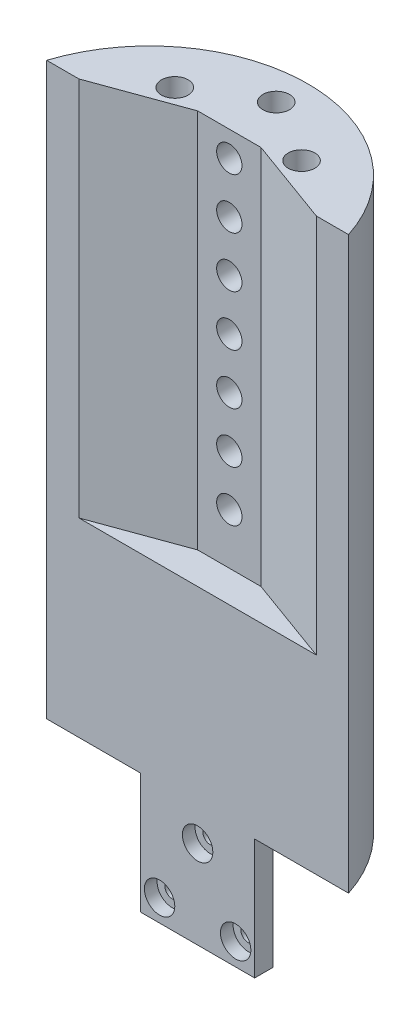
ISO-10303-21;
HEADER;
FILE_DESCRIPTION(('STEP AP214'),'2;1');
FILE_NAME('part.step','',(''),(''),'','','');
FILE_SCHEMA(('AUTOMOTIVE_DESIGN { 1 0 10303 214 1 1 1 1 }'));
ENDSEC;
DATA;
#1=APPLICATION_CONTEXT('core data for automotive mechanical design processes');
#2=APPLICATION_PROTOCOL_DEFINITION('international standard','automotive_design',2000,#1);
#3=PRODUCT_CONTEXT('',#1,'mechanical');
#4=PRODUCT('Part','Part','',(#3));
#5=PRODUCT_RELATED_PRODUCT_CATEGORY('part','',(#4));
#6=PRODUCT_DEFINITION_FORMATION('','',#4);
#7=PRODUCT_DEFINITION_CONTEXT('part definition',#1,'design');
#8=PRODUCT_DEFINITION('design','',#6,#7);
#9=PRODUCT_DEFINITION_SHAPE('','',#8);
#10=(LENGTH_UNIT() NAMED_UNIT(*) SI_UNIT(.MILLI.,.METRE.));
#11=(NAMED_UNIT(*) PLANE_ANGLE_UNIT() SI_UNIT($,.RADIAN.));
#12=(NAMED_UNIT(*) SI_UNIT($,.STERADIAN.) SOLID_ANGLE_UNIT());
#13=UNCERTAINTY_MEASURE_WITH_UNIT(LENGTH_MEASURE(1.E-05),#10,'distance_accuracy_value','');
#14=(GEOMETRIC_REPRESENTATION_CONTEXT(3) GLOBAL_UNCERTAINTY_ASSIGNED_CONTEXT((#13)) GLOBAL_UNIT_ASSIGNED_CONTEXT((#10,
#11,#12)) REPRESENTATION_CONTEXT('',''));
#15=CARTESIAN_POINT('',(0.,0.,0.));
#16=DIRECTION('',(0.,0.,1.));
#17=DIRECTION('',(1.,0.,0.));
#18=AXIS2_PLACEMENT_3D('',#15,#16,#17);
#19=CARTESIAN_POINT('',(0.,57.15,-9.652));
#20=DIRECTION('',(0.,0.,-1.));
#21=DIRECTION('',(-1.,0.,0.));
#22=AXIS2_PLACEMENT_3D('',#19,#20,#21);
#23=PLANE('',#22);
#24=CARTESIAN_POINT('',(0.,-63.6412473778275,-9.652));
#25=DIRECTION('',(0.,0.,1.));
#26=DIRECTION('',(1.,0.,0.));
#27=AXIS2_PLACEMENT_3D('',#24,#25,#26);
#28=CIRCLE('',#27,3.048);
#29=CARTESIAN_POINT('',(3.04799999999999,-63.6412473778275,-9.652));
#30=VERTEX_POINT('',#29);
#31=EDGE_CURVE('E270',#30,#30,#28,.T.);
#32=ORIENTED_EDGE('',*,*,#31,.F.);
#33=EDGE_LOOP('',(#32));
#34=FACE_BOUND('',#33,.T.);
#35=CARTESIAN_POINT('',(-7.62000000000001,-76.8394745315023,-9.652));
#36=DIRECTION('',(0.,0.,1.));
#37=DIRECTION('',(1.,0.,0.));
#38=AXIS2_PLACEMENT_3D('',#35,#36,#37);
#39=CIRCLE('',#38,3.048);
#40=CARTESIAN_POINT('',(-4.57200000000001,-76.8394745315023,-9.652));
#41=VERTEX_POINT('',#40);
#42=EDGE_CURVE('E274',#41,#41,#39,.T.);
#43=ORIENTED_EDGE('',*,*,#42,.F.);
#44=EDGE_LOOP('',(#43));
#45=FACE_BOUND('',#44,.T.);
#46=CARTESIAN_POINT('',(7.61999999999999,-76.8394745315023,-9.652));
#47=DIRECTION('',(0.,0.,1.));
#48=DIRECTION('',(1.,0.,0.));
#49=AXIS2_PLACEMENT_3D('',#46,#47,#48);
#50=CIRCLE('',#49,3.048);
#51=CARTESIAN_POINT('',(10.668,-76.8394745315023,-9.652));
#52=VERTEX_POINT('',#51);
#53=EDGE_CURVE('E282',#52,#52,#50,.T.);
#54=ORIENTED_EDGE('',*,*,#53,.F.);
#55=EDGE_LOOP('',(#54));
#56=FACE_BOUND('',#55,.T.);
#57=DIRECTION('',(0.,1.,0.));
#58=VECTOR('',#57,1.);
#59=CARTESIAN_POINT('',(23.796481613537,-37.6161579410358,-9.652));
#60=LINE('',#59,#58);
#61=CARTESIAN_POINT('',(23.796481613537,-19.05,-9.652));
#62=VERTEX_POINT('',#61);
#63=CARTESIAN_POINT('',(23.796481613537,57.15,-9.652));
#64=VERTEX_POINT('',#63);
#65=EDGE_CURVE('E140',#62,#64,#60,.T.);
#66=ORIENTED_EDGE('',*,*,#65,.F.);
#67=DIRECTION('',(1.,0.,0.));
#68=VECTOR('',#67,1.);
#69=CARTESIAN_POINT('',(6.35,-19.05,-9.652));
#70=LINE('',#69,#68);
#71=CARTESIAN_POINT('',(-23.796481613537,-19.05,-9.652));
#72=VERTEX_POINT('',#71);
#73=EDGE_CURVE('E124',#72,#62,#70,.T.);
#74=ORIENTED_EDGE('',*,*,#73,.F.);
#75=DIRECTION('',(0.,1.,0.));
#76=VECTOR('',#75,1.);
#77=CARTESIAN_POINT('',(-23.796481613537,-37.6161579410358,-9.652));
#78=LINE('',#77,#76);
#79=CARTESIAN_POINT('',(-23.796481613537,57.15,-9.652));
#80=VERTEX_POINT('',#79);
#81=EDGE_CURVE('E153',#72,#80,#78,.T.);
#82=ORIENTED_EDGE('',*,*,#81,.T.);
#83=DIRECTION('',(1.,0.,0.));
#84=VECTOR('',#83,1.);
#85=CARTESIAN_POINT('',(0.,57.15,-9.652));
#86=LINE('',#85,#84);
#87=CARTESIAN_POINT('',(-30.2473370067515,57.15,-9.652));
#88=VERTEX_POINT('',#87);
#89=EDGE_CURVE('E328',#88,#80,#86,.T.);
#90=ORIENTED_EDGE('',*,*,#89,.F.);
#91=DIRECTION('',(0.,-1.,0.));
#92=VECTOR('',#91,1.);
#93=CARTESIAN_POINT('',(-30.2473370067515,57.15,-9.652));
#94=LINE('',#93,#92);
#95=CARTESIAN_POINT('',(-30.2473370067515,-57.15,-9.652));
#96=VERTEX_POINT('',#95);
#97=EDGE_CURVE('E54',#88,#96,#94,.T.);
#98=ORIENTED_EDGE('',*,*,#97,.T.);
#99=DIRECTION('',(1.,0.,0.));
#100=VECTOR('',#99,1.);
#101=CARTESIAN_POINT('',(0.,-57.15,-9.652));
#102=LINE('',#101,#100);
#103=CARTESIAN_POINT('',(-11.43,-57.15,-9.652));
#104=VERTEX_POINT('',#103);
#105=EDGE_CURVE('E335',#96,#104,#102,.T.);
#106=ORIENTED_EDGE('',*,*,#105,.T.);
#107=DIRECTION('',(0.,1.,0.));
#108=VECTOR('',#107,1.);
#109=CARTESIAN_POINT('',(-11.43,-81.28,-9.652));
#110=LINE('',#109,#108);
#111=CARTESIAN_POINT('',(-11.43,-81.28,-9.652));
#112=VERTEX_POINT('',#111);
#113=EDGE_CURVE('E319',#112,#104,#110,.T.);
#114=ORIENTED_EDGE('',*,*,#113,.F.);
#115=DIRECTION('',(-1.,0.,0.));
#116=VECTOR('',#115,1.);
#117=CARTESIAN_POINT('',(0.,-81.28,-9.652));
#118=LINE('',#117,#116);
#119=CARTESIAN_POINT('',(11.43,-81.28,-9.652));
#120=VERTEX_POINT('',#119);
#121=EDGE_CURVE('E293',#120,#112,#118,.T.);
#122=ORIENTED_EDGE('',*,*,#121,.F.);
#123=DIRECTION('',(0.,1.,0.));
#124=VECTOR('',#123,1.);
#125=CARTESIAN_POINT('',(11.43,-81.28,-9.652));
#126=LINE('',#125,#124);
#127=CARTESIAN_POINT('',(11.43,-57.15,-9.652));
#128=VERTEX_POINT('',#127);
#129=EDGE_CURVE('E323',#120,#128,#126,.T.);
#130=ORIENTED_EDGE('',*,*,#129,.T.);
#131=CARTESIAN_POINT('',(30.2473370067515,-57.15,-9.652));
#132=VERTEX_POINT('',#131);
#133=EDGE_CURVE('E327',#128,#132,#102,.T.);
#134=ORIENTED_EDGE('',*,*,#133,.T.);
#135=DIRECTION('',(0.,-1.,0.));
#136=VECTOR('',#135,1.);
#137=CARTESIAN_POINT('',(30.2473370067515,57.15,-9.652));
#138=LINE('',#137,#136);
#139=CARTESIAN_POINT('',(30.2473370067515,57.15,-9.652));
#140=VERTEX_POINT('',#139);
#141=EDGE_CURVE('E11',#140,#132,#138,.T.);
#142=ORIENTED_EDGE('',*,*,#141,.F.);
#143=EDGE_CURVE('E146',#64,#140,#86,.T.);
#144=ORIENTED_EDGE('',*,*,#143,.F.);
#145=EDGE_LOOP('',(#66,#74,#82,#90,#98,#106,#114,#122,#130,#134,#142,#144));
#146=FACE_BOUND('',#145,.T.);
#147=ADVANCED_FACE('F45',(#34,#45,#56,#146),#23,.F.);
#148=CARTESIAN_POINT('',(0.,57.15,0.));
#149=DIRECTION('',(0.,-1.,0.));
#150=DIRECTION('',(0.,0.,-1.));
#151=AXIS2_PLACEMENT_3D('',#148,#149,#150);
#152=CYLINDRICAL_SURFACE('',#151,31.75);
#153=CARTESIAN_POINT('',(0.,-57.15,0.));
#154=DIRECTION('',(0.,1.,0.));
#155=DIRECTION('',(0.,0.,1.));
#156=AXIS2_PLACEMENT_3D('',#153,#154,#155);
#157=CIRCLE('',#156,31.75);
#158=EDGE_CURVE('E339',#132,#96,#157,.T.);
#159=ORIENTED_EDGE('',*,*,#158,.T.);
#160=ORIENTED_EDGE('',*,*,#97,.F.);
#161=CARTESIAN_POINT('',(0.,57.15,0.));
#162=DIRECTION('',(0.,1.,0.));
#163=DIRECTION('',(0.,0.,1.));
#164=AXIS2_PLACEMENT_3D('',#161,#162,#163);
#165=CIRCLE('',#164,31.75);
#166=EDGE_CURVE('E332',#140,#88,#165,.T.);
#167=ORIENTED_EDGE('',*,*,#166,.F.);
#168=ORIENTED_EDGE('',*,*,#141,.T.);
#169=EDGE_LOOP('',(#159,#160,#167,#168));
#170=FACE_BOUND('',#169,.T.);
#171=ADVANCED_FACE('F370',(#170),#152,.T.);
#172=CARTESIAN_POINT('',(0.,57.15,0.));
#173=DIRECTION('',(0.,1.,0.));
#174=DIRECTION('',(0.,0.,1.));
#175=AXIS2_PLACEMENT_3D('',#172,#173,#174);
#176=PLANE('',#175);
#177=DIRECTION('',(-0.939692620785909,0.,-0.342020143325666));
#178=VECTOR('',#177,1.);
#179=CARTESIAN_POINT('',(6.35,57.15,-16.002));
#180=LINE('',#179,#178);
#181=CARTESIAN_POINT('',(6.35,57.15,-16.002));
#182=VERTEX_POINT('',#181);
#183=EDGE_CURVE('E62',#64,#182,#180,.T.);
#184=ORIENTED_EDGE('',*,*,#183,.F.);
#185=ORIENTED_EDGE('',*,*,#143,.T.);
#186=ORIENTED_EDGE('',*,*,#166,.T.);
#187=ORIENTED_EDGE('',*,*,#89,.T.);
#188=DIRECTION('',(-0.939692620785909,0.,0.342020143325666));
#189=VECTOR('',#188,1.);
#190=CARTESIAN_POINT('',(-6.35000000000001,57.15,-16.002));
#191=LINE('',#190,#189);
#192=CARTESIAN_POINT('',(-6.35000000000001,57.15,-16.002));
#193=VERTEX_POINT('',#192);
#194=EDGE_CURVE('E150',#193,#80,#191,.T.);
#195=ORIENTED_EDGE('',*,*,#194,.F.);
#196=DIRECTION('',(-1.,0.,0.));
#197=VECTOR('',#196,1.);
#198=CARTESIAN_POINT('',(6.34999999999999,57.15,-16.002));
#199=LINE('',#198,#197);
#200=EDGE_CURVE('E240',#182,#193,#199,.T.);
#201=ORIENTED_EDGE('',*,*,#200,.F.);
#202=EDGE_LOOP('',(#184,#185,#186,#187,#195,#201));
#203=FACE_BOUND('',#202,.T.);
#204=CARTESIAN_POINT('',(0.,57.15,-25.4));
#205=DIRECTION('',(0.,1.,0.));
#206=DIRECTION('',(0.,0.,1.));
#207=AXIS2_PLACEMENT_3D('',#204,#205,#206);
#208=CIRCLE('',#207,2.667);
#209=CARTESIAN_POINT('',(0.,57.15,-22.733));
#210=VERTEX_POINT('',#209);
#211=EDGE_CURVE('E219',#210,#210,#208,.T.);
#212=ORIENTED_EDGE('',*,*,#211,.F.);
#213=EDGE_LOOP('',(#212));
#214=FACE_BOUND('',#213,.T.);
#215=CARTESIAN_POINT('',(-12.7,57.15,-17.78));
#216=DIRECTION('',(0.,1.,0.));
#217=DIRECTION('',(0.,0.,1.));
#218=AXIS2_PLACEMENT_3D('',#215,#216,#217);
#219=CIRCLE('',#218,2.667);
#220=CARTESIAN_POINT('',(-12.7,57.15,-15.113));
#221=VERTEX_POINT('',#220);
#222=EDGE_CURVE('E227',#221,#221,#219,.T.);
#223=ORIENTED_EDGE('',*,*,#222,.F.);
#224=EDGE_LOOP('',(#223));
#225=FACE_BOUND('',#224,.T.);
#226=CARTESIAN_POINT('',(12.7,57.15,-17.78));
#227=DIRECTION('',(0.,1.,0.));
#228=DIRECTION('',(0.,0.,1.));
#229=AXIS2_PLACEMENT_3D('',#226,#227,#228);
#230=CIRCLE('',#229,2.667);
#231=CARTESIAN_POINT('',(12.7,57.15,-15.113));
#232=VERTEX_POINT('',#231);
#233=EDGE_CURVE('E164',#232,#232,#230,.T.);
#234=ORIENTED_EDGE('',*,*,#233,.F.);
#235=EDGE_LOOP('',(#234));
#236=FACE_BOUND('',#235,.T.);
#237=ADVANCED_FACE('F375',(#203,#214,#225,#236),#176,.T.);
#238=CARTESIAN_POINT('',(0.,-57.15,0.));
#239=DIRECTION('',(0.,1.,0.));
#240=DIRECTION('',(0.,0.,1.));
#241=AXIS2_PLACEMENT_3D('',#238,#239,#240);
#242=PLANE('',#241);
#243=ORIENTED_EDGE('',*,*,#133,.F.);
#244=DIRECTION('',(0.,0.,-1.));
#245=VECTOR('',#244,1.);
#246=CARTESIAN_POINT('',(11.43,-57.15,0.));
#247=LINE('',#246,#245);
#248=CARTESIAN_POINT('',(11.43,-57.15,-13.335));
#249=VERTEX_POINT('',#248);
#250=EDGE_CURVE('E70',#128,#249,#247,.T.);
#251=ORIENTED_EDGE('',*,*,#250,.T.);
#252=DIRECTION('',(1.,0.,0.));
#253=VECTOR('',#252,1.);
#254=CARTESIAN_POINT('',(0.,-57.15,-13.335));
#255=LINE('',#254,#253);
#256=CARTESIAN_POINT('',(-11.43,-57.15,-13.335));
#257=VERTEX_POINT('',#256);
#258=EDGE_CURVE('E294',#257,#249,#255,.T.);
#259=ORIENTED_EDGE('',*,*,#258,.F.);
#260=DIRECTION('',(0.,0.,-1.));
#261=VECTOR('',#260,1.);
#262=CARTESIAN_POINT('',(-11.43,-57.15,0.));
#263=LINE('',#262,#261);
#264=EDGE_CURVE('E306',#104,#257,#263,.T.);
#265=ORIENTED_EDGE('',*,*,#264,.F.);
#266=ORIENTED_EDGE('',*,*,#105,.F.);
#267=ORIENTED_EDGE('',*,*,#158,.F.);
#268=EDGE_LOOP('',(#243,#251,#259,#265,#266,#267));
#269=FACE_BOUND('',#268,.T.);
#270=ADVANCED_FACE('F413',(#269),#242,.F.);
#271=CARTESIAN_POINT('',(11.43,-81.28,0.));
#272=DIRECTION('',(1.,0.,0.));
#273=DIRECTION('',(0.,0.,-1.));
#274=AXIS2_PLACEMENT_3D('',#271,#272,#273);
#275=PLANE('',#274);
#276=ORIENTED_EDGE('',*,*,#250,.F.);
#277=ORIENTED_EDGE('',*,*,#129,.F.);
#278=DIRECTION('',(0.,0.,-1.));
#279=VECTOR('',#278,1.);
#280=CARTESIAN_POINT('',(11.43,-81.28,0.));
#281=LINE('',#280,#279);
#282=CARTESIAN_POINT('',(11.43,-81.28,-13.335));
#283=VERTEX_POINT('',#282);
#284=EDGE_CURVE('E289',#120,#283,#281,.T.);
#285=ORIENTED_EDGE('',*,*,#284,.T.);
#286=DIRECTION('',(0.,1.,0.));
#287=VECTOR('',#286,1.);
#288=CARTESIAN_POINT('',(11.43,-81.28,-13.335));
#289=LINE('',#288,#287);
#290=EDGE_CURVE('E303',#283,#249,#289,.T.);
#291=ORIENTED_EDGE('',*,*,#290,.T.);
#292=EDGE_LOOP('',(#276,#277,#285,#291));
#293=FACE_BOUND('',#292,.T.);
#294=ADVANCED_FACE('F409',(#293),#275,.T.);
#295=CARTESIAN_POINT('',(-11.43,-81.28,0.));
#296=DIRECTION('',(1.,0.,0.));
#297=DIRECTION('',(0.,0.,-1.));
#298=AXIS2_PLACEMENT_3D('',#295,#296,#297);
#299=PLANE('',#298);
#300=ORIENTED_EDGE('',*,*,#264,.T.);
#301=DIRECTION('',(0.,1.,0.));
#302=VECTOR('',#301,1.);
#303=CARTESIAN_POINT('',(-11.43,-81.28,-13.335));
#304=LINE('',#303,#302);
#305=CARTESIAN_POINT('',(-11.43,-81.28,-13.335));
#306=VERTEX_POINT('',#305);
#307=EDGE_CURVE('E315',#306,#257,#304,.T.);
#308=ORIENTED_EDGE('',*,*,#307,.F.);
#309=DIRECTION('',(0.,0.,-1.));
#310=VECTOR('',#309,1.);
#311=CARTESIAN_POINT('',(-11.43,-81.28,0.));
#312=LINE('',#311,#310);
#313=EDGE_CURVE('E297',#112,#306,#312,.T.);
#314=ORIENTED_EDGE('',*,*,#313,.F.);
#315=ORIENTED_EDGE('',*,*,#113,.T.);
#316=EDGE_LOOP('',(#300,#308,#314,#315));
#317=FACE_BOUND('',#316,.T.);
#318=ADVANCED_FACE('F405',(#317),#299,.F.);
#319=CARTESIAN_POINT('',(0.,-81.28,-13.335));
#320=DIRECTION('',(0.,0.,1.));
#321=DIRECTION('',(1.,0.,0.));
#322=AXIS2_PLACEMENT_3D('',#319,#320,#321);
#323=PLANE('',#322);
#324=CARTESIAN_POINT('',(0.,-63.6412473778275,-13.335));
#325=DIRECTION('',(0.,0.,1.));
#326=DIRECTION('',(1.,0.,0.));
#327=AXIS2_PLACEMENT_3D('',#324,#325,#326);
#328=CIRCLE('',#327,1.49999999999999);
#329=CARTESIAN_POINT('',(1.49999999999998,-63.6412473778275,-13.335));
#330=VERTEX_POINT('',#329);
#331=EDGE_CURVE('E48',#330,#330,#328,.T.);
#332=ORIENTED_EDGE('',*,*,#331,.T.);
#333=EDGE_LOOP('',(#332));
#334=FACE_BOUND('',#333,.T.);
#335=CARTESIAN_POINT('',(7.61999999999999,-76.8394745315023,-13.335));
#336=DIRECTION('',(0.,0.,1.));
#337=DIRECTION('',(1.,0.,0.));
#338=AXIS2_PLACEMENT_3D('',#335,#336,#337);
#339=CIRCLE('',#338,1.49999999999999);
#340=CARTESIAN_POINT('',(9.11999999999998,-76.8394745315023,-13.335));
#341=VERTEX_POINT('',#340);
#342=EDGE_CURVE('E255',#341,#341,#339,.T.);
#343=ORIENTED_EDGE('',*,*,#342,.T.);
#344=EDGE_LOOP('',(#343));
#345=FACE_BOUND('',#344,.T.);
#346=CARTESIAN_POINT('',(-7.62000000000001,-76.8394745315023,-13.335));
#347=DIRECTION('',(0.,0.,1.));
#348=DIRECTION('',(1.,0.,0.));
#349=AXIS2_PLACEMENT_3D('',#346,#347,#348);
#350=CIRCLE('',#349,1.49999999999999);
#351=CARTESIAN_POINT('',(-6.12000000000002,-76.8394745315023,-13.335));
#352=VERTEX_POINT('',#351);
#353=EDGE_CURVE('E261',#352,#352,#350,.T.);
#354=ORIENTED_EDGE('',*,*,#353,.T.);
#355=EDGE_LOOP('',(#354));
#356=FACE_BOUND('',#355,.T.);
#357=ORIENTED_EDGE('',*,*,#258,.T.);
#358=ORIENTED_EDGE('',*,*,#290,.F.);
#359=DIRECTION('',(1.,0.,0.));
#360=VECTOR('',#359,1.);
#361=CARTESIAN_POINT('',(0.,-81.28,-13.335));
#362=LINE('',#361,#360);
#363=EDGE_CURVE('E300',#306,#283,#362,.T.);
#364=ORIENTED_EDGE('',*,*,#363,.F.);
#365=ORIENTED_EDGE('',*,*,#307,.T.);
#366=EDGE_LOOP('',(#357,#358,#364,#365));
#367=FACE_BOUND('',#366,.T.);
#368=ADVANCED_FACE('F351',(#334,#345,#356,#367),#323,.F.);
#369=CARTESIAN_POINT('',(0.,-81.28,0.));
#370=DIRECTION('',(0.,-1.,0.));
#371=DIRECTION('',(0.,0.,-1.));
#372=AXIS2_PLACEMENT_3D('',#369,#370,#371);
#373=PLANE('',#372);
#374=ORIENTED_EDGE('',*,*,#284,.F.);
#375=ORIENTED_EDGE('',*,*,#121,.T.);
#376=ORIENTED_EDGE('',*,*,#313,.T.);
#377=ORIENTED_EDGE('',*,*,#363,.T.);
#378=EDGE_LOOP('',(#374,#375,#376,#377));
#379=FACE_BOUND('',#378,.T.);
#380=ADVANCED_FACE('F386',(#379),#373,.T.);
#381=CARTESIAN_POINT('',(7.61999999999999,-76.8394745315023,-12.192));
#382=DIRECTION('',(0.,0.,1.));
#383=DIRECTION('',(1.,0.,0.));
#384=AXIS2_PLACEMENT_3D('',#381,#382,#383);
#385=CYLINDRICAL_SURFACE('',#384,3.048);
#386=CARTESIAN_POINT('',(7.61999999999999,-76.8394745315023,-12.192));
#387=DIRECTION('',(0.,0.,1.));
#388=DIRECTION('',(1.,0.,0.));
#389=AXIS2_PLACEMENT_3D('',#386,#387,#388);
#390=CIRCLE('',#389,3.048);
#391=CARTESIAN_POINT('',(10.668,-76.8394745315023,-12.192));
#392=VERTEX_POINT('',#391);
#393=EDGE_CURVE('E265',#392,#392,#390,.T.);
#394=ORIENTED_EDGE('',*,*,#393,.F.);
#395=EDGE_LOOP('',(#394));
#396=FACE_BOUND('',#395,.T.);
#397=ORIENTED_EDGE('',*,*,#53,.T.);
#398=EDGE_LOOP('',(#397));
#399=FACE_BOUND('',#398,.T.);
#400=ADVANCED_FACE('F383',(#396,#399),#385,.F.);
#401=CARTESIAN_POINT('',(7.61999999999999,-76.8394745315023,-12.192));
#402=DIRECTION('',(0.,0.,1.));
#403=DIRECTION('',(1.,0.,0.));
#404=AXIS2_PLACEMENT_3D('',#401,#402,#403);
#405=PLANE('',#404);
#406=CARTESIAN_POINT('',(7.61999999999999,-76.8394745315023,-12.192));
#407=DIRECTION('',(0.,0.,1.));
#408=DIRECTION('',(1.,0.,0.));
#409=AXIS2_PLACEMENT_3D('',#406,#407,#408);
#410=CIRCLE('',#409,1.49999999999999);
#411=CARTESIAN_POINT('',(9.11999999999998,-76.8394745315023,-12.192));
#412=VERTEX_POINT('',#411);
#413=EDGE_CURVE('E256',#412,#412,#410,.T.);
#414=ORIENTED_EDGE('',*,*,#413,.F.);
#415=EDGE_LOOP('',(#414));
#416=FACE_BOUND('',#415,.T.);
#417=ORIENTED_EDGE('',*,*,#393,.T.);
#418=EDGE_LOOP('',(#417));
#419=FACE_BOUND('',#418,.T.);
#420=ADVANCED_FACE('F385',(#416,#419),#405,.T.);
#421=CARTESIAN_POINT('',(-7.62000000000001,-76.8394745315023,-12.192));
#422=DIRECTION('',(0.,0.,1.));
#423=DIRECTION('',(1.,0.,0.));
#424=AXIS2_PLACEMENT_3D('',#421,#422,#423);
#425=CYLINDRICAL_SURFACE('',#424,3.048);
#426=CARTESIAN_POINT('',(-7.62000000000001,-76.8394745315023,-12.192));
#427=DIRECTION('',(0.,0.,1.));
#428=DIRECTION('',(1.,0.,0.));
#429=AXIS2_PLACEMENT_3D('',#426,#427,#428);
#430=CIRCLE('',#429,3.048);
#431=CARTESIAN_POINT('',(-4.57200000000001,-76.8394745315023,-12.192));
#432=VERTEX_POINT('',#431);
#433=EDGE_CURVE('E278',#432,#432,#430,.T.);
#434=ORIENTED_EDGE('',*,*,#433,.F.);
#435=EDGE_LOOP('',(#434));
#436=FACE_BOUND('',#435,.T.);
#437=ORIENTED_EDGE('',*,*,#42,.T.);
#438=EDGE_LOOP('',(#437));
#439=FACE_BOUND('',#438,.T.);
#440=ADVANCED_FACE('F393',(#436,#439),#425,.F.);
#441=CARTESIAN_POINT('',(-7.62000000000001,-76.8394745315023,-12.192));
#442=DIRECTION('',(0.,0.,1.));
#443=DIRECTION('',(1.,0.,0.));
#444=AXIS2_PLACEMENT_3D('',#441,#442,#443);
#445=PLANE('',#444);
#446=CARTESIAN_POINT('',(-7.62000000000001,-76.8394745315023,-12.192));
#447=DIRECTION('',(0.,0.,1.));
#448=DIRECTION('',(1.,0.,0.));
#449=AXIS2_PLACEMENT_3D('',#446,#447,#448);
#450=CIRCLE('',#449,1.49999999999999);
#451=CARTESIAN_POINT('',(-6.12000000000002,-76.8394745315023,-12.192));
#452=VERTEX_POINT('',#451);
#453=EDGE_CURVE('E260',#452,#452,#450,.T.);
#454=ORIENTED_EDGE('',*,*,#453,.F.);
#455=EDGE_LOOP('',(#454));
#456=FACE_BOUND('',#455,.T.);
#457=ORIENTED_EDGE('',*,*,#433,.T.);
#458=EDGE_LOOP('',(#457));
#459=FACE_BOUND('',#458,.T.);
#460=ADVANCED_FACE('F400',(#456,#459),#445,.T.);
#461=CARTESIAN_POINT('',(0.,-63.6412473778275,-12.192));
#462=DIRECTION('',(0.,0.,1.));
#463=DIRECTION('',(1.,0.,0.));
#464=AXIS2_PLACEMENT_3D('',#461,#462,#463);
#465=CYLINDRICAL_SURFACE('',#464,3.048);
#466=CARTESIAN_POINT('',(0.,-63.6412473778275,-12.192));
#467=DIRECTION('',(0.,0.,1.));
#468=DIRECTION('',(1.,0.,0.));
#469=AXIS2_PLACEMENT_3D('',#466,#467,#468);
#470=CIRCLE('',#469,3.048);
#471=CARTESIAN_POINT('',(3.04799999999999,-63.6412473778275,-12.192));
#472=VERTEX_POINT('',#471);
#473=EDGE_CURVE('E266',#472,#472,#470,.T.);
#474=ORIENTED_EDGE('',*,*,#473,.F.);
#475=EDGE_LOOP('',(#474));
#476=FACE_BOUND('',#475,.T.);
#477=ORIENTED_EDGE('',*,*,#31,.T.);
#478=EDGE_LOOP('',(#477));
#479=FACE_BOUND('',#478,.T.);
#480=ADVANCED_FACE('F691',(#476,#479),#465,.F.);
#481=CARTESIAN_POINT('',(0.,-63.6412473778275,-12.192));
#482=DIRECTION('',(0.,0.,1.));
#483=DIRECTION('',(1.,0.,0.));
#484=AXIS2_PLACEMENT_3D('',#481,#482,#483);
#485=PLANE('',#484);
#486=CARTESIAN_POINT('',(0.,-63.6412473778275,-12.192));
#487=DIRECTION('',(0.,0.,1.));
#488=DIRECTION('',(1.,0.,0.));
#489=AXIS2_PLACEMENT_3D('',#486,#487,#488);
#490=CIRCLE('',#489,1.49999999999999);
#491=CARTESIAN_POINT('',(1.49999999999998,-63.6412473778275,-12.192));
#492=VERTEX_POINT('',#491);
#493=EDGE_CURVE('E251',#492,#492,#490,.T.);
#494=ORIENTED_EDGE('',*,*,#493,.F.);
#495=EDGE_LOOP('',(#494));
#496=FACE_BOUND('',#495,.T.);
#497=ORIENTED_EDGE('',*,*,#473,.T.);
#498=EDGE_LOOP('',(#497));
#499=FACE_BOUND('',#498,.T.);
#500=ADVANCED_FACE('F366',(#496,#499),#485,.T.);
#501=CARTESIAN_POINT('',(-7.62000000000001,-76.8394745315023,-9.652));
#502=DIRECTION('',(0.,0.,1.));
#503=DIRECTION('',(1.,0.,0.));
#504=AXIS2_PLACEMENT_3D('',#501,#502,#503);
#505=CYLINDRICAL_SURFACE('',#504,1.49999999999999);
#506=ORIENTED_EDGE('',*,*,#453,.T.);
#507=EDGE_LOOP('',(#506));
#508=FACE_BOUND('',#507,.T.);
#509=ORIENTED_EDGE('',*,*,#353,.F.);
#510=EDGE_LOOP('',(#509));
#511=FACE_BOUND('',#510,.T.);
#512=ADVANCED_FACE('F357',(#508,#511),#505,.F.);
#513=CARTESIAN_POINT('',(7.61999999999999,-76.8394745315023,-9.652));
#514=DIRECTION('',(0.,0.,1.));
#515=DIRECTION('',(1.,0.,0.));
#516=AXIS2_PLACEMENT_3D('',#513,#514,#515);
#517=CYLINDRICAL_SURFACE('',#516,1.49999999999999);
#518=ORIENTED_EDGE('',*,*,#413,.T.);
#519=EDGE_LOOP('',(#518));
#520=FACE_BOUND('',#519,.T.);
#521=ORIENTED_EDGE('',*,*,#342,.F.);
#522=EDGE_LOOP('',(#521));
#523=FACE_BOUND('',#522,.T.);
#524=ADVANCED_FACE('F354',(#520,#523),#517,.F.);
#525=CARTESIAN_POINT('',(0.,-63.6412473778275,-9.652));
#526=DIRECTION('',(0.,0.,1.));
#527=DIRECTION('',(1.,0.,0.));
#528=AXIS2_PLACEMENT_3D('',#525,#526,#527);
#529=CYLINDRICAL_SURFACE('',#528,1.49999999999999);
#530=ORIENTED_EDGE('',*,*,#493,.T.);
#531=EDGE_LOOP('',(#530));
#532=FACE_BOUND('',#531,.T.);
#533=ORIENTED_EDGE('',*,*,#331,.F.);
#534=EDGE_LOOP('',(#533));
#535=FACE_BOUND('',#534,.T.);
#536=ADVANCED_FACE('F356',(#532,#535),#529,.F.);
#537=CARTESIAN_POINT('',(6.35,-19.05,-16.002));
#538=DIRECTION('',(0.,-1.,0.));
#539=DIRECTION('',(0.,0.,-1.));
#540=AXIS2_PLACEMENT_3D('',#537,#538,#539);
#541=PLANE('',#540);
#542=ORIENTED_EDGE('',*,*,#73,.T.);
#543=DIRECTION('',(-0.93969262078591,0.,-0.342020143325666));
#544=VECTOR('',#543,1.);
#545=CARTESIAN_POINT('',(6.35,-19.05,-16.002));
#546=LINE('',#545,#544);
#547=CARTESIAN_POINT('',(6.35,-19.05,-16.002));
#548=VERTEX_POINT('',#547);
#549=EDGE_CURVE('E128',#62,#548,#546,.T.);
#550=ORIENTED_EDGE('',*,*,#549,.T.);
#551=DIRECTION('',(1.,0.,0.));
#552=VECTOR('',#551,1.);
#553=CARTESIAN_POINT('',(6.35,-19.05,-16.002));
#554=LINE('',#553,#552);
#555=CARTESIAN_POINT('',(-6.35,-19.05,-16.002));
#556=VERTEX_POINT('',#555);
#557=EDGE_CURVE('E248',#556,#548,#554,.T.);
#558=ORIENTED_EDGE('',*,*,#557,.F.);
#559=DIRECTION('',(-0.93969262078591,0.,0.342020143325666));
#560=VECTOR('',#559,1.);
#561=CARTESIAN_POINT('',(-6.35000000000001,-19.05,-16.002));
#562=LINE('',#561,#560);
#563=EDGE_CURVE('E130',#556,#72,#562,.T.);
#564=ORIENTED_EDGE('',*,*,#563,.T.);
#565=EDGE_LOOP('',(#542,#550,#558,#564));
#566=FACE_BOUND('',#565,.T.);
#567=ADVANCED_FACE('F126',(#566),#541,.F.);
#568=CARTESIAN_POINT('',(0.,0.,-16.002));
#569=DIRECTION('',(0.,0.,-1.));
#570=DIRECTION('',(-1.,0.,0.));
#571=AXIS2_PLACEMENT_3D('',#568,#569,#570);
#572=PLANE('',#571);
#573=CARTESIAN_POINT('',(0.,52.07,-16.002));
#574=DIRECTION('',(0.,0.,1.));
#575=DIRECTION('',(1.,0.,0.));
#576=AXIS2_PLACEMENT_3D('',#573,#574,#575);
#577=CIRCLE('',#576,2.54);
#578=CARTESIAN_POINT('',(2.54,52.07,-16.002));
#579=VERTEX_POINT('',#578);
#580=EDGE_CURVE('E165',#579,#579,#577,.T.);
#581=ORIENTED_EDGE('',*,*,#580,.F.);
#582=EDGE_LOOP('',(#581));
#583=FACE_BOUND('',#582,.T.);
#584=CARTESIAN_POINT('',(0.,41.91,-16.002));
#585=DIRECTION('',(0.,0.,1.));
#586=DIRECTION('',(1.,0.,0.));
#587=AXIS2_PLACEMENT_3D('',#584,#585,#586);
#588=CIRCLE('',#587,2.54);
#589=CARTESIAN_POINT('',(2.54,41.91,-16.002));
#590=VERTEX_POINT('',#589);
#591=EDGE_CURVE('E169',#590,#590,#588,.T.);
#592=ORIENTED_EDGE('',*,*,#591,.F.);
#593=EDGE_LOOP('',(#592));
#594=FACE_BOUND('',#593,.T.);
#595=CARTESIAN_POINT('',(0.,31.75,-16.002));
#596=DIRECTION('',(0.,0.,1.));
#597=DIRECTION('',(1.,0.,0.));
#598=AXIS2_PLACEMENT_3D('',#595,#596,#597);
#599=CIRCLE('',#598,2.54);
#600=CARTESIAN_POINT('',(2.54,31.75,-16.002));
#601=VERTEX_POINT('',#600);
#602=EDGE_CURVE('E177',#601,#601,#599,.T.);
#603=ORIENTED_EDGE('',*,*,#602,.F.);
#604=EDGE_LOOP('',(#603));
#605=FACE_BOUND('',#604,.T.);
#606=CARTESIAN_POINT('',(0.,21.59,-16.002));
#607=DIRECTION('',(0.,0.,1.));
#608=DIRECTION('',(1.,0.,0.));
#609=AXIS2_PLACEMENT_3D('',#606,#607,#608);
#610=CIRCLE('',#609,2.54);
#611=CARTESIAN_POINT('',(2.54,21.59,-16.002));
#612=VERTEX_POINT('',#611);
#613=EDGE_CURVE('E185',#612,#612,#610,.T.);
#614=ORIENTED_EDGE('',*,*,#613,.F.);
#615=EDGE_LOOP('',(#614));
#616=FACE_BOUND('',#615,.T.);
#617=CARTESIAN_POINT('',(0.,11.43,-16.002));
#618=DIRECTION('',(0.,0.,1.));
#619=DIRECTION('',(1.,0.,0.));
#620=AXIS2_PLACEMENT_3D('',#617,#618,#619);
#621=CIRCLE('',#620,2.54);
#622=CARTESIAN_POINT('',(2.54,11.43,-16.002));
#623=VERTEX_POINT('',#622);
#624=EDGE_CURVE('E193',#623,#623,#621,.T.);
#625=ORIENTED_EDGE('',*,*,#624,.F.);
#626=EDGE_LOOP('',(#625));
#627=FACE_BOUND('',#626,.T.);
#628=CARTESIAN_POINT('',(0.,1.27,-16.002));
#629=DIRECTION('',(0.,0.,1.));
#630=DIRECTION('',(1.,0.,0.));
#631=AXIS2_PLACEMENT_3D('',#628,#629,#630);
#632=CIRCLE('',#631,2.54);
#633=CARTESIAN_POINT('',(2.54,1.27,-16.002));
#634=VERTEX_POINT('',#633);
#635=EDGE_CURVE('E201',#634,#634,#632,.T.);
#636=ORIENTED_EDGE('',*,*,#635,.F.);
#637=EDGE_LOOP('',(#636));
#638=FACE_BOUND('',#637,.T.);
#639=CARTESIAN_POINT('',(0.,-8.89,-16.002));
#640=DIRECTION('',(0.,0.,1.));
#641=DIRECTION('',(1.,0.,0.));
#642=AXIS2_PLACEMENT_3D('',#639,#640,#641);
#643=CIRCLE('',#642,2.54);
#644=CARTESIAN_POINT('',(2.54,-8.89,-16.002));
#645=VERTEX_POINT('',#644);
#646=EDGE_CURVE('E209',#645,#645,#643,.T.);
#647=ORIENTED_EDGE('',*,*,#646,.F.);
#648=EDGE_LOOP('',(#647));
#649=FACE_BOUND('',#648,.T.);
#650=DIRECTION('',(0.,1.,0.));
#651=VECTOR('',#650,1.);
#652=CARTESIAN_POINT('',(6.34999999999999,57.15,-16.002));
#653=LINE('',#652,#651);
#654=EDGE_CURVE('E136',#548,#182,#653,.T.);
#655=ORIENTED_EDGE('',*,*,#654,.T.);
#656=ORIENTED_EDGE('',*,*,#200,.T.);
#657=DIRECTION('',(0.,-1.,0.));
#658=VECTOR('',#657,1.);
#659=CARTESIAN_POINT('',(-6.35000000000001,57.15,-16.002));
#660=LINE('',#659,#658);
#661=EDGE_CURVE('E244',#193,#556,#660,.T.);
#662=ORIENTED_EDGE('',*,*,#661,.T.);
#663=ORIENTED_EDGE('',*,*,#557,.T.);
#664=EDGE_LOOP('',(#655,#656,#662,#663));
#665=FACE_BOUND('',#664,.T.);
#666=ADVANCED_FACE('F440',(#583,#594,#605,#616,#627,#638,#649,#665),#572,.F.);
#667=CARTESIAN_POINT('',(12.7,52.07,-17.78));
#668=DIRECTION('',(0.,1.,0.));
#669=DIRECTION('',(0.,0.,1.));
#670=AXIS2_PLACEMENT_3D('',#667,#668,#669);
#671=CYLINDRICAL_SURFACE('',#670,2.667);
#672=CARTESIAN_POINT('',(12.7,52.07,-17.78));
#673=DIRECTION('',(0.,1.,0.));
#674=DIRECTION('',(0.,0.,1.));
#675=AXIS2_PLACEMENT_3D('',#672,#673,#674);
#676=CIRCLE('',#675,2.667);
#677=CARTESIAN_POINT('',(12.7,52.07,-15.113));
#678=VERTEX_POINT('',#677);
#679=EDGE_CURVE('E231',#678,#678,#676,.T.);
#680=ORIENTED_EDGE('',*,*,#679,.F.);
#681=EDGE_LOOP('',(#680));
#682=FACE_BOUND('',#681,.T.);
#683=ORIENTED_EDGE('',*,*,#233,.T.);
#684=EDGE_LOOP('',(#683));
#685=FACE_BOUND('',#684,.T.);
#686=ADVANCED_FACE('F525',(#682,#685),#671,.F.);
#687=CARTESIAN_POINT('',(0.,52.07,0.));
#688=DIRECTION('',(0.,1.,0.));
#689=DIRECTION('',(0.,0.,1.));
#690=AXIS2_PLACEMENT_3D('',#687,#688,#689);
#691=PLANE('',#690);
#692=ORIENTED_EDGE('',*,*,#679,.T.);
#693=EDGE_LOOP('',(#692));
#694=FACE_BOUND('',#693,.T.);
#695=ADVANCED_FACE('F521',(#694),#691,.T.);
#696=CARTESIAN_POINT('',(-12.7,52.07,-17.78));
#697=DIRECTION('',(0.,1.,0.));
#698=DIRECTION('',(0.,0.,1.));
#699=AXIS2_PLACEMENT_3D('',#696,#697,#698);
#700=CYLINDRICAL_SURFACE('',#699,2.667);
#701=CARTESIAN_POINT('',(-12.7,52.07,-17.78));
#702=DIRECTION('',(0.,1.,0.));
#703=DIRECTION('',(0.,0.,1.));
#704=AXIS2_PLACEMENT_3D('',#701,#702,#703);
#705=CIRCLE('',#704,2.667);
#706=CARTESIAN_POINT('',(-12.7,52.07,-15.113));
#707=VERTEX_POINT('',#706);
#708=EDGE_CURVE('E223',#707,#707,#705,.T.);
#709=ORIENTED_EDGE('',*,*,#708,.F.);
#710=EDGE_LOOP('',(#709));
#711=FACE_BOUND('',#710,.T.);
#712=ORIENTED_EDGE('',*,*,#222,.T.);
#713=EDGE_LOOP('',(#712));
#714=FACE_BOUND('',#713,.T.);
#715=ADVANCED_FACE('F517',(#711,#714),#700,.F.);
#716=CARTESIAN_POINT('',(0.,52.07,0.));
#717=DIRECTION('',(0.,1.,0.));
#718=DIRECTION('',(0.,0.,1.));
#719=AXIS2_PLACEMENT_3D('',#716,#717,#718);
#720=PLANE('',#719);
#721=ORIENTED_EDGE('',*,*,#708,.T.);
#722=EDGE_LOOP('',(#721));
#723=FACE_BOUND('',#722,.T.);
#724=ADVANCED_FACE('F513',(#723),#720,.T.);
#725=CARTESIAN_POINT('',(0.,52.07,-25.4));
#726=DIRECTION('',(0.,1.,0.));
#727=DIRECTION('',(0.,0.,1.));
#728=AXIS2_PLACEMENT_3D('',#725,#726,#727);
#729=CYLINDRICAL_SURFACE('',#728,2.667);
#730=CARTESIAN_POINT('',(0.,52.07,-25.4));
#731=DIRECTION('',(0.,1.,0.));
#732=DIRECTION('',(0.,0.,1.));
#733=AXIS2_PLACEMENT_3D('',#730,#731,#732);
#734=CIRCLE('',#733,2.667);
#735=CARTESIAN_POINT('',(0.,52.07,-22.733));
#736=VERTEX_POINT('',#735);
#737=EDGE_CURVE('E137',#736,#736,#734,.T.);
#738=ORIENTED_EDGE('',*,*,#737,.F.);
#739=EDGE_LOOP('',(#738));
#740=FACE_BOUND('',#739,.T.);
#741=ORIENTED_EDGE('',*,*,#211,.T.);
#742=EDGE_LOOP('',(#741));
#743=FACE_BOUND('',#742,.T.);
#744=ADVANCED_FACE('F509',(#740,#743),#729,.F.);
#745=CARTESIAN_POINT('',(0.,52.07,0.));
#746=DIRECTION('',(0.,1.,0.));
#747=DIRECTION('',(0.,0.,1.));
#748=AXIS2_PLACEMENT_3D('',#745,#746,#747);
#749=PLANE('',#748);
#750=ORIENTED_EDGE('',*,*,#737,.T.);
#751=EDGE_LOOP('',(#750));
#752=FACE_BOUND('',#751,.T.);
#753=ADVANCED_FACE('F502',(#752),#749,.T.);
#754=CARTESIAN_POINT('',(0.,-8.89,-22.352));
#755=DIRECTION('',(0.,0.,1.));
#756=DIRECTION('',(1.,0.,0.));
#757=AXIS2_PLACEMENT_3D('',#754,#755,#756);
#758=CYLINDRICAL_SURFACE('',#757,2.54);
#759=CARTESIAN_POINT('',(0.,-8.89,-22.352));
#760=DIRECTION('',(0.,0.,1.));
#761=DIRECTION('',(1.,0.,0.));
#762=AXIS2_PLACEMENT_3D('',#759,#760,#761);
#763=CIRCLE('',#762,2.54);
#764=CARTESIAN_POINT('',(2.54,-8.89,-22.352));
#765=VERTEX_POINT('',#764);
#766=EDGE_CURVE('E142',#765,#765,#763,.T.);
#767=ORIENTED_EDGE('',*,*,#766,.F.);
#768=EDGE_LOOP('',(#767));
#769=FACE_BOUND('',#768,.T.);
#770=ORIENTED_EDGE('',*,*,#646,.T.);
#771=EDGE_LOOP('',(#770));
#772=FACE_BOUND('',#771,.T.);
#773=ADVANCED_FACE('F499',(#769,#772),#758,.F.);
#774=CARTESIAN_POINT('',(0.,-8.89,-22.352));
#775=DIRECTION('',(0.,0.,1.));
#776=DIRECTION('',(1.,0.,0.));
#777=AXIS2_PLACEMENT_3D('',#774,#775,#776);
#778=PLANE('',#777);
#779=ORIENTED_EDGE('',*,*,#766,.T.);
#780=EDGE_LOOP('',(#779));
#781=FACE_BOUND('',#780,.T.);
#782=ADVANCED_FACE('F494',(#781),#778,.T.);
#783=CARTESIAN_POINT('',(0.,1.27,-22.352));
#784=DIRECTION('',(0.,0.,1.));
#785=DIRECTION('',(1.,0.,0.));
#786=AXIS2_PLACEMENT_3D('',#783,#784,#785);
#787=CYLINDRICAL_SURFACE('',#786,2.54);
#788=CARTESIAN_POINT('',(0.,1.27,-22.352));
#789=DIRECTION('',(0.,0.,1.));
#790=DIRECTION('',(1.,0.,0.));
#791=AXIS2_PLACEMENT_3D('',#788,#789,#790);
#792=CIRCLE('',#791,2.54);
#793=CARTESIAN_POINT('',(2.54,1.27,-22.352));
#794=VERTEX_POINT('',#793);
#795=EDGE_CURVE('E205',#794,#794,#792,.T.);
#796=ORIENTED_EDGE('',*,*,#795,.F.);
#797=EDGE_LOOP('',(#796));
#798=FACE_BOUND('',#797,.T.);
#799=ORIENTED_EDGE('',*,*,#635,.T.);
#800=EDGE_LOOP('',(#799));
#801=FACE_BOUND('',#800,.T.);
#802=ADVANCED_FACE('F491',(#798,#801),#787,.F.);
#803=CARTESIAN_POINT('',(0.,1.27,-22.352));
#804=DIRECTION('',(0.,0.,1.));
#805=DIRECTION('',(1.,0.,0.));
#806=AXIS2_PLACEMENT_3D('',#803,#804,#805);
#807=PLANE('',#806);
#808=ORIENTED_EDGE('',*,*,#795,.T.);
#809=EDGE_LOOP('',(#808));
#810=FACE_BOUND('',#809,.T.);
#811=ADVANCED_FACE('F486',(#810),#807,.T.);
#812=CARTESIAN_POINT('',(0.,11.43,-22.352));
#813=DIRECTION('',(0.,0.,1.));
#814=DIRECTION('',(1.,0.,0.));
#815=AXIS2_PLACEMENT_3D('',#812,#813,#814);
#816=CYLINDRICAL_SURFACE('',#815,2.54);
#817=CARTESIAN_POINT('',(0.,11.43,-22.352));
#818=DIRECTION('',(0.,0.,1.));
#819=DIRECTION('',(1.,0.,0.));
#820=AXIS2_PLACEMENT_3D('',#817,#818,#819);
#821=CIRCLE('',#820,2.54);
#822=CARTESIAN_POINT('',(2.54,11.43,-22.352));
#823=VERTEX_POINT('',#822);
#824=EDGE_CURVE('E197',#823,#823,#821,.T.);
#825=ORIENTED_EDGE('',*,*,#824,.F.);
#826=EDGE_LOOP('',(#825));
#827=FACE_BOUND('',#826,.T.);
#828=ORIENTED_EDGE('',*,*,#624,.T.);
#829=EDGE_LOOP('',(#828));
#830=FACE_BOUND('',#829,.T.);
#831=ADVANCED_FACE('F483',(#827,#830),#816,.F.);
#832=CARTESIAN_POINT('',(0.,11.43,-22.352));
#833=DIRECTION('',(0.,0.,1.));
#834=DIRECTION('',(1.,0.,0.));
#835=AXIS2_PLACEMENT_3D('',#832,#833,#834);
#836=PLANE('',#835);
#837=ORIENTED_EDGE('',*,*,#824,.T.);
#838=EDGE_LOOP('',(#837));
#839=FACE_BOUND('',#838,.T.);
#840=ADVANCED_FACE('F478',(#839),#836,.T.);
#841=CARTESIAN_POINT('',(0.,21.59,-22.352));
#842=DIRECTION('',(0.,0.,1.));
#843=DIRECTION('',(1.,0.,0.));
#844=AXIS2_PLACEMENT_3D('',#841,#842,#843);
#845=CYLINDRICAL_SURFACE('',#844,2.54);
#846=CARTESIAN_POINT('',(0.,21.59,-22.352));
#847=DIRECTION('',(0.,0.,1.));
#848=DIRECTION('',(1.,0.,0.));
#849=AXIS2_PLACEMENT_3D('',#846,#847,#848);
#850=CIRCLE('',#849,2.54);
#851=CARTESIAN_POINT('',(2.54,21.59,-22.352));
#852=VERTEX_POINT('',#851);
#853=EDGE_CURVE('E189',#852,#852,#850,.T.);
#854=ORIENTED_EDGE('',*,*,#853,.F.);
#855=EDGE_LOOP('',(#854));
#856=FACE_BOUND('',#855,.T.);
#857=ORIENTED_EDGE('',*,*,#613,.T.);
#858=EDGE_LOOP('',(#857));
#859=FACE_BOUND('',#858,.T.);
#860=ADVANCED_FACE('F475',(#856,#859),#845,.F.);
#861=CARTESIAN_POINT('',(0.,21.59,-22.352));
#862=DIRECTION('',(0.,0.,1.));
#863=DIRECTION('',(1.,0.,0.));
#864=AXIS2_PLACEMENT_3D('',#861,#862,#863);
#865=PLANE('',#864);
#866=ORIENTED_EDGE('',*,*,#853,.T.);
#867=EDGE_LOOP('',(#866));
#868=FACE_BOUND('',#867,.T.);
#869=ADVANCED_FACE('F470',(#868),#865,.T.);
#870=CARTESIAN_POINT('',(0.,31.75,-22.352));
#871=DIRECTION('',(0.,0.,1.));
#872=DIRECTION('',(1.,0.,0.));
#873=AXIS2_PLACEMENT_3D('',#870,#871,#872);
#874=CYLINDRICAL_SURFACE('',#873,2.54);
#875=CARTESIAN_POINT('',(0.,31.75,-22.352));
#876=DIRECTION('',(0.,0.,1.));
#877=DIRECTION('',(1.,0.,0.));
#878=AXIS2_PLACEMENT_3D('',#875,#876,#877);
#879=CIRCLE('',#878,2.54);
#880=CARTESIAN_POINT('',(2.54,31.75,-22.352));
#881=VERTEX_POINT('',#880);
#882=EDGE_CURVE('E181',#881,#881,#879,.T.);
#883=ORIENTED_EDGE('',*,*,#882,.F.);
#884=EDGE_LOOP('',(#883));
#885=FACE_BOUND('',#884,.T.);
#886=ORIENTED_EDGE('',*,*,#602,.T.);
#887=EDGE_LOOP('',(#886));
#888=FACE_BOUND('',#887,.T.);
#889=ADVANCED_FACE('F467',(#885,#888),#874,.F.);
#890=CARTESIAN_POINT('',(0.,31.75,-22.352));
#891=DIRECTION('',(0.,0.,1.));
#892=DIRECTION('',(1.,0.,0.));
#893=AXIS2_PLACEMENT_3D('',#890,#891,#892);
#894=PLANE('',#893);
#895=ORIENTED_EDGE('',*,*,#882,.T.);
#896=EDGE_LOOP('',(#895));
#897=FACE_BOUND('',#896,.T.);
#898=ADVANCED_FACE('F462',(#897),#894,.T.);
#899=CARTESIAN_POINT('',(0.,41.91,-22.352));
#900=DIRECTION('',(0.,0.,1.));
#901=DIRECTION('',(1.,0.,0.));
#902=AXIS2_PLACEMENT_3D('',#899,#900,#901);
#903=CYLINDRICAL_SURFACE('',#902,2.54);
#904=CARTESIAN_POINT('',(0.,41.91,-22.352));
#905=DIRECTION('',(0.,0.,1.));
#906=DIRECTION('',(1.,0.,0.));
#907=AXIS2_PLACEMENT_3D('',#904,#905,#906);
#908=CIRCLE('',#907,2.54);
#909=CARTESIAN_POINT('',(2.54,41.91,-22.352));
#910=VERTEX_POINT('',#909);
#911=EDGE_CURVE('E173',#910,#910,#908,.T.);
#912=ORIENTED_EDGE('',*,*,#911,.F.);
#913=EDGE_LOOP('',(#912));
#914=FACE_BOUND('',#913,.T.);
#915=ORIENTED_EDGE('',*,*,#591,.T.);
#916=EDGE_LOOP('',(#915));
#917=FACE_BOUND('',#916,.T.);
#918=ADVANCED_FACE('F459',(#914,#917),#903,.F.);
#919=CARTESIAN_POINT('',(0.,41.91,-22.352));
#920=DIRECTION('',(0.,0.,1.));
#921=DIRECTION('',(1.,0.,0.));
#922=AXIS2_PLACEMENT_3D('',#919,#920,#921);
#923=PLANE('',#922);
#924=ORIENTED_EDGE('',*,*,#911,.T.);
#925=EDGE_LOOP('',(#924));
#926=FACE_BOUND('',#925,.T.);
#927=ADVANCED_FACE('F457',(#926),#923,.T.);
#928=CARTESIAN_POINT('',(0.,52.07,-22.352));
#929=DIRECTION('',(0.,0.,1.));
#930=DIRECTION('',(1.,0.,0.));
#931=AXIS2_PLACEMENT_3D('',#928,#929,#930);
#932=CYLINDRICAL_SURFACE('',#931,2.54);
#933=CARTESIAN_POINT('',(0.,52.07,-22.352));
#934=DIRECTION('',(0.,0.,1.));
#935=DIRECTION('',(1.,0.,0.));
#936=AXIS2_PLACEMENT_3D('',#933,#934,#935);
#937=CIRCLE('',#936,2.54);
#938=CARTESIAN_POINT('',(2.54,52.07,-22.352));
#939=VERTEX_POINT('',#938);
#940=EDGE_CURVE('E160',#939,#939,#937,.T.);
#941=ORIENTED_EDGE('',*,*,#940,.F.);
#942=EDGE_LOOP('',(#941));
#943=FACE_BOUND('',#942,.T.);
#944=ORIENTED_EDGE('',*,*,#580,.T.);
#945=EDGE_LOOP('',(#944));
#946=FACE_BOUND('',#945,.T.);
#947=ADVANCED_FACE('F451',(#943,#946),#932,.F.);
#948=CARTESIAN_POINT('',(0.,52.07,-22.352));
#949=DIRECTION('',(0.,0.,1.));
#950=DIRECTION('',(1.,0.,0.));
#951=AXIS2_PLACEMENT_3D('',#948,#949,#950);
#952=PLANE('',#951);
#953=ORIENTED_EDGE('',*,*,#940,.T.);
#954=EDGE_LOOP('',(#953));
#955=FACE_BOUND('',#954,.T.);
#956=ADVANCED_FACE('F444',(#955),#952,.T.);
#957=CARTESIAN_POINT('',(-6.35000000000001,-37.6161579410358,-16.002));
#958=DIRECTION('',(-0.342020143325666,0.,-0.939692620785909));
#959=DIRECTION('',(-0.93969262078591,0.,0.342020143325666));
#960=AXIS2_PLACEMENT_3D('',#957,#958,#959);
#961=PLANE('',#960);
#962=ORIENTED_EDGE('',*,*,#661,.F.);
#963=ORIENTED_EDGE('',*,*,#194,.T.);
#964=ORIENTED_EDGE('',*,*,#81,.F.);
#965=ORIENTED_EDGE('',*,*,#563,.F.);
#966=EDGE_LOOP('',(#962,#963,#964,#965));
#967=FACE_BOUND('',#966,.T.);
#968=ADVANCED_FACE('F442',(#967),#961,.F.);
#969=CARTESIAN_POINT('',(6.35,-37.6161579410358,-16.002));
#970=DIRECTION('',(0.342020143325666,0.,-0.939692620785909));
#971=DIRECTION('',(-0.93969262078591,0.,-0.342020143325666));
#972=AXIS2_PLACEMENT_3D('',#969,#970,#971);
#973=PLANE('',#972);
#974=ORIENTED_EDGE('',*,*,#65,.T.);
#975=ORIENTED_EDGE('',*,*,#183,.T.);
#976=ORIENTED_EDGE('',*,*,#654,.F.);
#977=ORIENTED_EDGE('',*,*,#549,.F.);
#978=EDGE_LOOP('',(#974,#975,#976,#977));
#979=FACE_BOUND('',#978,.T.);
#980=ADVANCED_FACE('F139',(#979),#973,.F.);
#981=CLOSED_SHELL('',(#147,#171,#237,#270,#294,#318,#368,#380,#400,#420,#440,#460,#480,#500,
#512,#524,#536,#567,#666,#686,#695,#715,#724,#744,#753,#773,#782,#802,#811,#831,#840,#860,#869,
#889,#898,#918,#927,#947,#956,#968,#980));
#982=MANIFOLD_SOLID_BREP('B2',#981);
#983=ADVANCED_BREP_SHAPE_REPRESENTATION('',(#18,#982),#14);
#984=SHAPE_DEFINITION_REPRESENTATION(#9,#983);
ENDSEC;
END-ISO-10303-21;
